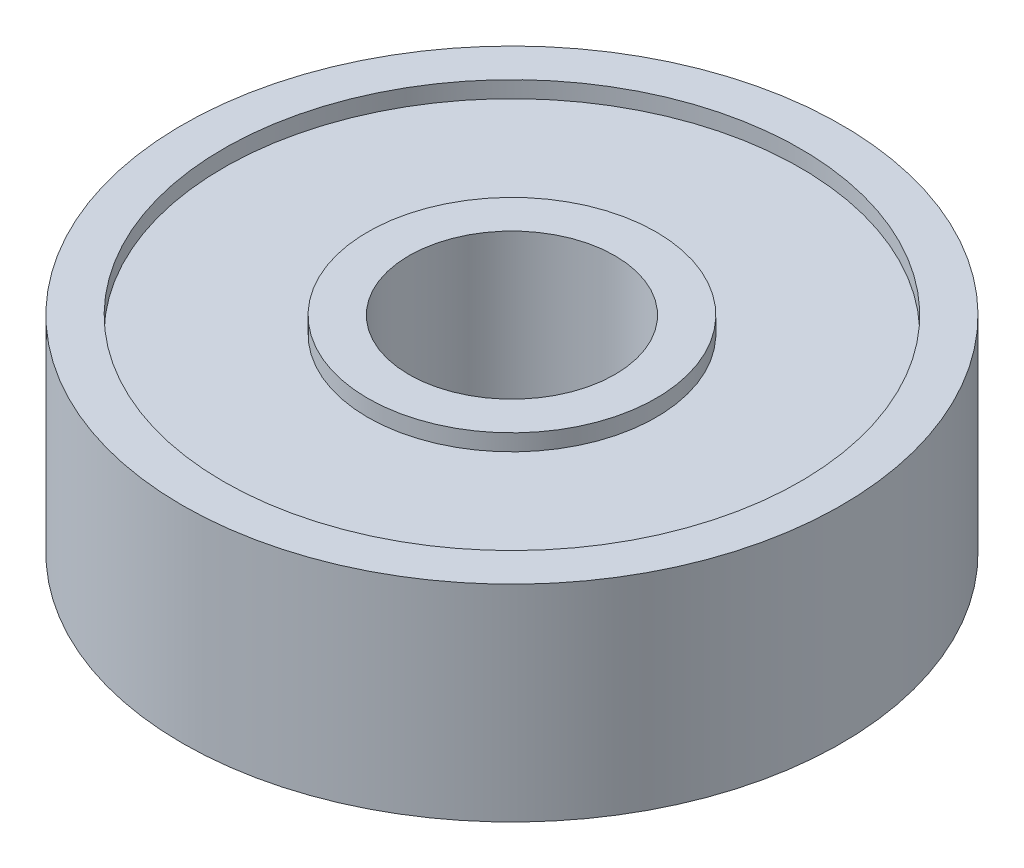
ISO-10303-21;
HEADER;
FILE_DESCRIPTION(('STEP AP214'),'2;1');
FILE_NAME('part.step','',(''),(''),'','','');
FILE_SCHEMA(('AUTOMOTIVE_DESIGN { 1 0 10303 214 1 1 1 1 }'));
ENDSEC;
DATA;
#1=APPLICATION_CONTEXT('core data for automotive mechanical design processes');
#2=APPLICATION_PROTOCOL_DEFINITION('international standard','automotive_design',2000,#1);
#3=PRODUCT_CONTEXT('',#1,'mechanical');
#4=PRODUCT('Part','Part','',(#3));
#5=PRODUCT_RELATED_PRODUCT_CATEGORY('part','',(#4));
#6=PRODUCT_DEFINITION_FORMATION('','',#4);
#7=PRODUCT_DEFINITION_CONTEXT('part definition',#1,'design');
#8=PRODUCT_DEFINITION('design','',#6,#7);
#9=PRODUCT_DEFINITION_SHAPE('','',#8);
#10=(LENGTH_UNIT() NAMED_UNIT(*) SI_UNIT(.MILLI.,.METRE.));
#11=(NAMED_UNIT(*) PLANE_ANGLE_UNIT() SI_UNIT($,.RADIAN.));
#12=(NAMED_UNIT(*) SI_UNIT($,.STERADIAN.) SOLID_ANGLE_UNIT());
#13=UNCERTAINTY_MEASURE_WITH_UNIT(LENGTH_MEASURE(1.E-05),#10,'distance_accuracy_value','');
#14=(GEOMETRIC_REPRESENTATION_CONTEXT(3) GLOBAL_UNCERTAINTY_ASSIGNED_CONTEXT((#13)) GLOBAL_UNIT_ASSIGNED_CONTEXT((#10,
#11,#12)) REPRESENTATION_CONTEXT('',''));
#15=CARTESIAN_POINT('',(0.,0.,0.));
#16=DIRECTION('',(0.,0.,1.));
#17=DIRECTION('',(1.,0.,0.));
#18=AXIS2_PLACEMENT_3D('',#15,#16,#17);
#19=CARTESIAN_POINT('',(0.,-2.5,0.));
#20=DIRECTION('',(0.,1.,0.));
#21=DIRECTION('',(0.,0.,1.));
#22=AXIS2_PLACEMENT_3D('',#19,#20,#21);
#23=PLANE('',#22);
#24=CARTESIAN_POINT('',(0.,-2.5,0.));
#25=DIRECTION('',(0.,1.,0.));
#26=DIRECTION('',(0.,0.,1.));
#27=AXIS2_PLACEMENT_3D('',#24,#25,#26);
#28=CIRCLE('',#27,2.5);
#29=CARTESIAN_POINT('',(0.,-2.5,2.5));
#30=VERTEX_POINT('',#29);
#31=EDGE_CURVE('E43',#30,#30,#28,.T.);
#32=ORIENTED_EDGE('',*,*,#31,.T.);
#33=EDGE_LOOP('',(#32));
#34=FACE_BOUND('',#33,.T.);
#35=CARTESIAN_POINT('',(0.,-2.5,0.));
#36=DIRECTION('',(0.,1.,0.));
#37=DIRECTION('',(0.,0.,1.));
#38=AXIS2_PLACEMENT_3D('',#35,#36,#37);
#39=CIRCLE('',#38,3.5);
#40=CARTESIAN_POINT('',(0.,-2.5,3.5));
#41=VERTEX_POINT('',#40);
#42=EDGE_CURVE('E71',#41,#41,#39,.T.);
#43=ORIENTED_EDGE('',*,*,#42,.F.);
#44=EDGE_LOOP('',(#43));
#45=FACE_BOUND('',#44,.T.);
#46=ADVANCED_FACE('F32',(#34,#45),#23,.F.);
#47=CARTESIAN_POINT('',(0.,2.5,0.));
#48=DIRECTION('',(0.,1.,0.));
#49=DIRECTION('',(0.,0.,1.));
#50=AXIS2_PLACEMENT_3D('',#47,#48,#49);
#51=PLANE('',#50);
#52=CARTESIAN_POINT('',(0.,2.5,0.));
#53=DIRECTION('',(0.,1.,0.));
#54=DIRECTION('',(0.,0.,1.));
#55=AXIS2_PLACEMENT_3D('',#52,#53,#54);
#56=CIRCLE('',#55,2.5);
#57=CARTESIAN_POINT('',(0.,2.5,2.5));
#58=VERTEX_POINT('',#57);
#59=EDGE_CURVE('E47',#58,#58,#56,.T.);
#60=ORIENTED_EDGE('',*,*,#59,.F.);
#61=EDGE_LOOP('',(#60));
#62=FACE_BOUND('',#61,.T.);
#63=CARTESIAN_POINT('',(0.,2.5,0.));
#64=DIRECTION('',(0.,1.,0.));
#65=DIRECTION('',(0.,0.,1.));
#66=AXIS2_PLACEMENT_3D('',#63,#64,#65);
#67=CIRCLE('',#66,3.5);
#68=CARTESIAN_POINT('',(0.,2.5,3.5));
#69=VERTEX_POINT('',#68);
#70=EDGE_CURVE('E59',#69,#69,#67,.T.);
#71=ORIENTED_EDGE('',*,*,#70,.T.);
#72=EDGE_LOOP('',(#71));
#73=FACE_BOUND('',#72,.T.);
#74=ADVANCED_FACE('F87',(#62,#73),#51,.T.);
#75=CARTESIAN_POINT('',(0.,-2.5,0.));
#76=DIRECTION('',(0.,1.,0.));
#77=DIRECTION('',(0.,0.,1.));
#78=AXIS2_PLACEMENT_3D('',#75,#76,#77);
#79=CYLINDRICAL_SURFACE('',#78,8.);
#80=CARTESIAN_POINT('',(0.,-2.5,0.));
#81=DIRECTION('',(0.,1.,0.));
#82=DIRECTION('',(0.,0.,1.));
#83=AXIS2_PLACEMENT_3D('',#80,#81,#82);
#84=CIRCLE('',#83,8.);
#85=CARTESIAN_POINT('',(0.,-2.5,8.));
#86=VERTEX_POINT('',#85);
#87=EDGE_CURVE('E10',#86,#86,#84,.T.);
#88=ORIENTED_EDGE('',*,*,#87,.T.);
#89=EDGE_LOOP('',(#88));
#90=FACE_BOUND('',#89,.T.);
#91=CARTESIAN_POINT('',(0.,2.5,0.));
#92=DIRECTION('',(0.,1.,0.));
#93=DIRECTION('',(0.,0.,1.));
#94=AXIS2_PLACEMENT_3D('',#91,#92,#93);
#95=CIRCLE('',#94,8.);
#96=CARTESIAN_POINT('',(0.,2.5,8.));
#97=VERTEX_POINT('',#96);
#98=EDGE_CURVE('E39',#97,#97,#95,.T.);
#99=ORIENTED_EDGE('',*,*,#98,.F.);
#100=EDGE_LOOP('',(#99));
#101=FACE_BOUND('',#100,.T.);
#102=ADVANCED_FACE('F34',(#90,#101),#79,.T.);
#103=CARTESIAN_POINT('',(0.,-2.5,0.));
#104=DIRECTION('',(0.,1.,0.));
#105=DIRECTION('',(0.,0.,1.));
#106=AXIS2_PLACEMENT_3D('',#103,#104,#105);
#107=CIRCLE('',#106,7.);
#108=CARTESIAN_POINT('',(0.,-2.5,7.));
#109=VERTEX_POINT('',#108);
#110=EDGE_CURVE('E65',#109,#109,#107,.T.);
#111=ORIENTED_EDGE('',*,*,#110,.T.);
#112=EDGE_LOOP('',(#111));
#113=FACE_BOUND('',#112,.T.);
#114=ORIENTED_EDGE('',*,*,#87,.F.);
#115=EDGE_LOOP('',(#114));
#116=FACE_BOUND('',#115,.T.);
#117=ADVANCED_FACE('F89',(#113,#116),#23,.F.);
#118=CARTESIAN_POINT('',(0.,2.5,0.));
#119=DIRECTION('',(0.,1.,0.));
#120=DIRECTION('',(0.,0.,1.));
#121=AXIS2_PLACEMENT_3D('',#118,#119,#120);
#122=CIRCLE('',#121,7.);
#123=CARTESIAN_POINT('',(0.,2.5,7.));
#124=VERTEX_POINT('',#123);
#125=EDGE_CURVE('E53',#124,#124,#122,.T.);
#126=ORIENTED_EDGE('',*,*,#125,.F.);
#127=EDGE_LOOP('',(#126));
#128=FACE_BOUND('',#127,.T.);
#129=ORIENTED_EDGE('',*,*,#98,.T.);
#130=EDGE_LOOP('',(#129));
#131=FACE_BOUND('',#130,.T.);
#132=ADVANCED_FACE('F95',(#128,#131),#51,.T.);
#133=CARTESIAN_POINT('',(0.,-2.5,0.));
#134=DIRECTION('',(0.,1.,0.));
#135=DIRECTION('',(0.,0.,1.));
#136=AXIS2_PLACEMENT_3D('',#133,#134,#135);
#137=CYLINDRICAL_SURFACE('',#136,2.5);
#138=ORIENTED_EDGE('',*,*,#31,.F.);
#139=EDGE_LOOP('',(#138));
#140=FACE_BOUND('',#139,.T.);
#141=ORIENTED_EDGE('',*,*,#59,.T.);
#142=EDGE_LOOP('',(#141));
#143=FACE_BOUND('',#142,.T.);
#144=ADVANCED_FACE('F102',(#140,#143),#137,.F.);
#145=CARTESIAN_POINT('',(0.,2.1,0.));
#146=DIRECTION('',(0.,1.,0.));
#147=DIRECTION('',(0.,0.,1.));
#148=AXIS2_PLACEMENT_3D('',#145,#146,#147);
#149=CYLINDRICAL_SURFACE('',#148,7.);
#150=CARTESIAN_POINT('',(0.,2.1,0.));
#151=DIRECTION('',(0.,1.,0.));
#152=DIRECTION('',(0.,0.,1.));
#153=AXIS2_PLACEMENT_3D('',#150,#151,#152);
#154=CIRCLE('',#153,7.);
#155=CARTESIAN_POINT('',(0.,2.1,7.));
#156=VERTEX_POINT('',#155);
#157=EDGE_CURVE('E51',#156,#156,#154,.T.);
#158=ORIENTED_EDGE('',*,*,#157,.F.);
#159=EDGE_LOOP('',(#158));
#160=FACE_BOUND('',#159,.T.);
#161=ORIENTED_EDGE('',*,*,#125,.T.);
#162=EDGE_LOOP('',(#161));
#163=FACE_BOUND('',#162,.T.);
#164=ADVANCED_FACE('F123',(#160,#163),#149,.F.);
#165=CARTESIAN_POINT('',(0.,2.1,0.));
#166=DIRECTION('',(0.,1.,0.));
#167=DIRECTION('',(0.,0.,1.));
#168=AXIS2_PLACEMENT_3D('',#165,#166,#167);
#169=PLANE('',#168);
#170=CARTESIAN_POINT('',(0.,2.1,0.));
#171=DIRECTION('',(0.,1.,0.));
#172=DIRECTION('',(0.,0.,1.));
#173=AXIS2_PLACEMENT_3D('',#170,#171,#172);
#174=CIRCLE('',#173,3.5);
#175=CARTESIAN_POINT('',(0.,2.1,3.5));
#176=VERTEX_POINT('',#175);
#177=EDGE_CURVE('E56',#176,#176,#174,.T.);
#178=ORIENTED_EDGE('',*,*,#177,.F.);
#179=EDGE_LOOP('',(#178));
#180=FACE_BOUND('',#179,.T.);
#181=ORIENTED_EDGE('',*,*,#157,.T.);
#182=EDGE_LOOP('',(#181));
#183=FACE_BOUND('',#182,.T.);
#184=ADVANCED_FACE('F119',(#180,#183),#169,.T.);
#185=CARTESIAN_POINT('',(0.,2.1,0.));
#186=DIRECTION('',(0.,1.,0.));
#187=DIRECTION('',(0.,0.,1.));
#188=AXIS2_PLACEMENT_3D('',#185,#186,#187);
#189=CYLINDRICAL_SURFACE('',#188,3.5);
#190=ORIENTED_EDGE('',*,*,#177,.T.);
#191=EDGE_LOOP('',(#190));
#192=FACE_BOUND('',#191,.T.);
#193=ORIENTED_EDGE('',*,*,#70,.F.);
#194=EDGE_LOOP('',(#193));
#195=FACE_BOUND('',#194,.T.);
#196=ADVANCED_FACE('F113',(#192,#195),#189,.T.);
#197=CARTESIAN_POINT('',(0.,-2.1,0.));
#198=DIRECTION('',(0.,-1.,0.));
#199=DIRECTION('',(0.,0.,1.));
#200=AXIS2_PLACEMENT_3D('',#197,#198,#199);
#201=PLANE('',#200);
#202=CARTESIAN_POINT('',(0.,-2.1,0.));
#203=DIRECTION('',(0.,1.,0.));
#204=DIRECTION('',(0.,0.,1.));
#205=AXIS2_PLACEMENT_3D('',#202,#203,#204);
#206=CIRCLE('',#205,7.);
#207=CARTESIAN_POINT('',(0.,-2.1,7.));
#208=VERTEX_POINT('',#207);
#209=EDGE_CURVE('E62',#208,#208,#206,.T.);
#210=ORIENTED_EDGE('',*,*,#209,.F.);
#211=EDGE_LOOP('',(#210));
#212=FACE_BOUND('',#211,.T.);
#213=CARTESIAN_POINT('',(0.,-2.1,0.));
#214=DIRECTION('',(0.,1.,0.));
#215=DIRECTION('',(0.,0.,1.));
#216=AXIS2_PLACEMENT_3D('',#213,#214,#215);
#217=CIRCLE('',#216,3.5);
#218=CARTESIAN_POINT('',(0.,-2.1,3.5));
#219=VERTEX_POINT('',#218);
#220=EDGE_CURVE('E68',#219,#219,#217,.T.);
#221=ORIENTED_EDGE('',*,*,#220,.T.);
#222=EDGE_LOOP('',(#221));
#223=FACE_BOUND('',#222,.T.);
#224=ADVANCED_FACE('F77',(#212,#223),#201,.T.);
#225=CARTESIAN_POINT('',(0.,-2.1,0.));
#226=DIRECTION('',(0.,-1.,0.));
#227=DIRECTION('',(0.,0.,-1.));
#228=AXIS2_PLACEMENT_3D('',#225,#226,#227);
#229=CYLINDRICAL_SURFACE('',#228,7.);
#230=ORIENTED_EDGE('',*,*,#209,.T.);
#231=EDGE_LOOP('',(#230));
#232=FACE_BOUND('',#231,.T.);
#233=ORIENTED_EDGE('',*,*,#110,.F.);
#234=EDGE_LOOP('',(#233));
#235=FACE_BOUND('',#234,.T.);
#236=ADVANCED_FACE('F82',(#232,#235),#229,.F.);
#237=CARTESIAN_POINT('',(0.,-2.1,0.));
#238=DIRECTION('',(0.,-1.,0.));
#239=DIRECTION('',(0.,0.,-1.));
#240=AXIS2_PLACEMENT_3D('',#237,#238,#239);
#241=CYLINDRICAL_SURFACE('',#240,3.5);
#242=ORIENTED_EDGE('',*,*,#220,.F.);
#243=EDGE_LOOP('',(#242));
#244=FACE_BOUND('',#243,.T.);
#245=ORIENTED_EDGE('',*,*,#42,.T.);
#246=EDGE_LOOP('',(#245));
#247=FACE_BOUND('',#246,.T.);
#248=ADVANCED_FACE('F79',(#244,#247),#241,.T.);
#249=CLOSED_SHELL('',(#46,#74,#102,#117,#132,#144,#164,#184,#196,#224,#236,#248));
#250=MANIFOLD_SOLID_BREP('B2',#249);
#251=ADVANCED_BREP_SHAPE_REPRESENTATION('',(#18,#250),#14);
#252=SHAPE_DEFINITION_REPRESENTATION(#9,#251);
ENDSEC;
END-ISO-10303-21;
